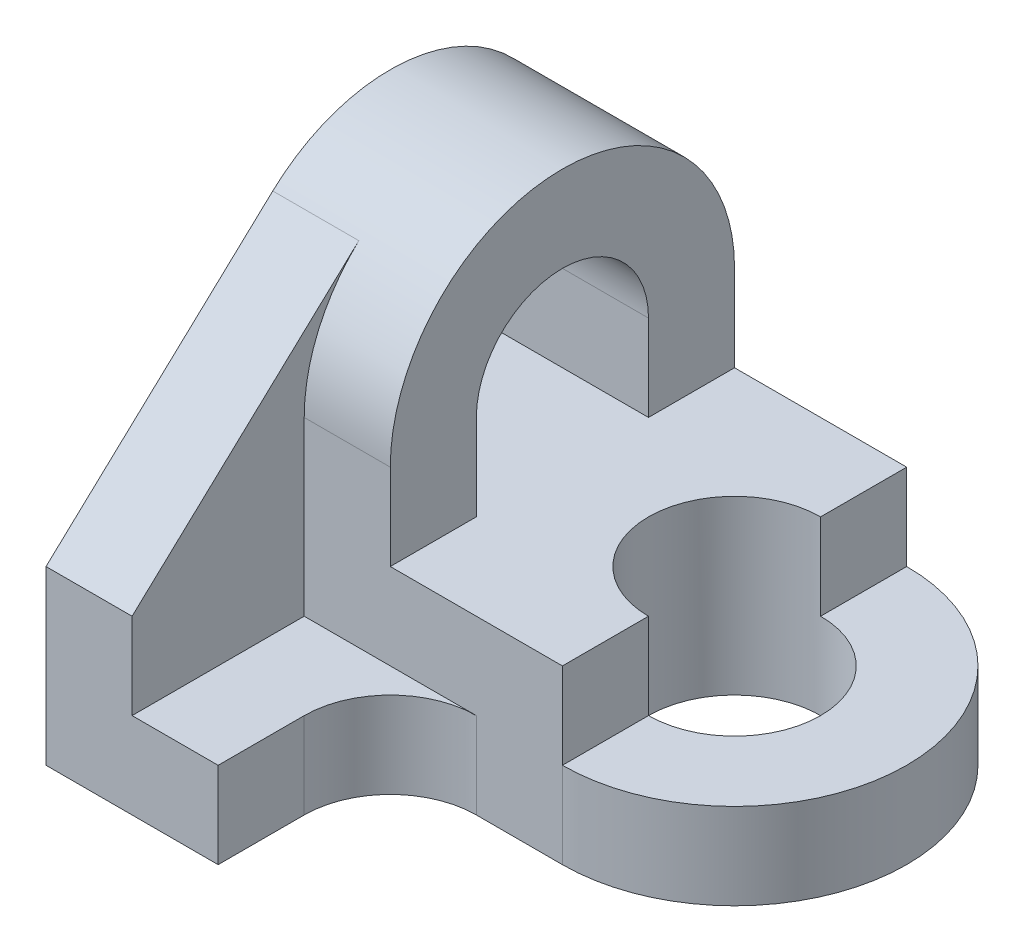
ISO-10303-21;
HEADER;
FILE_DESCRIPTION(('STEP AP214'),'2;1');
FILE_NAME('part.step','',(''),(''),'','','');
FILE_SCHEMA(('AUTOMOTIVE_DESIGN { 1 0 10303 214 1 1 1 1 }'));
ENDSEC;
DATA;
#1=APPLICATION_CONTEXT('core data for automotive mechanical design processes');
#2=APPLICATION_PROTOCOL_DEFINITION('international standard','automotive_design',2000,#1);
#3=PRODUCT_CONTEXT('',#1,'mechanical');
#4=PRODUCT('Part','Part','',(#3));
#5=PRODUCT_RELATED_PRODUCT_CATEGORY('part','',(#4));
#6=PRODUCT_DEFINITION_FORMATION('','',#4);
#7=PRODUCT_DEFINITION_CONTEXT('part definition',#1,'design');
#8=PRODUCT_DEFINITION('design','',#6,#7);
#9=PRODUCT_DEFINITION_SHAPE('','',#8);
#10=(LENGTH_UNIT() NAMED_UNIT(*) SI_UNIT(.MILLI.,.METRE.));
#11=(NAMED_UNIT(*) PLANE_ANGLE_UNIT() SI_UNIT($,.RADIAN.));
#12=(NAMED_UNIT(*) SI_UNIT($,.STERADIAN.) SOLID_ANGLE_UNIT());
#13=UNCERTAINTY_MEASURE_WITH_UNIT(LENGTH_MEASURE(1.E-05),#10,'distance_accuracy_value','');
#14=(GEOMETRIC_REPRESENTATION_CONTEXT(3) GLOBAL_UNCERTAINTY_ASSIGNED_CONTEXT((#13)) GLOBAL_UNIT_ASSIGNED_CONTEXT((#10,
#11,#12)) REPRESENTATION_CONTEXT('',''));
#15=CARTESIAN_POINT('',(0.,0.,0.));
#16=DIRECTION('',(0.,0.,1.));
#17=DIRECTION('',(1.,0.,0.));
#18=AXIS2_PLACEMENT_3D('',#15,#16,#17);
#19=CARTESIAN_POINT('',(0.,0.,0.));
#20=DIRECTION('',(-1.,0.,0.));
#21=DIRECTION('',(0.,0.,1.));
#22=AXIS2_PLACEMENT_3D('',#19,#20,#21);
#23=PLANE('',#22);
#24=DIRECTION('',(0.,1.,0.));
#25=VECTOR('',#24,1.);
#26=CARTESIAN_POINT('',(0.,-0.999999999999999,5.));
#27=LINE('',#26,#25);
#28=CARTESIAN_POINT('',(0.,-0.999999999999999,5.));
#29=VERTEX_POINT('',#28);
#30=CARTESIAN_POINT('',(0.,0.,5.));
#31=VERTEX_POINT('',#30);
#32=EDGE_CURVE('E169',#29,#31,#27,.T.);
#33=ORIENTED_EDGE('',*,*,#32,.T.);
#34=DIRECTION('',(0.,0.,-1.));
#35=VECTOR('',#34,1.);
#36=CARTESIAN_POINT('',(0.,0.,6.));
#37=LINE('',#36,#35);
#38=CARTESIAN_POINT('',(0.,0.,6.));
#39=VERTEX_POINT('',#38);
#40=EDGE_CURVE('E272',#39,#31,#37,.T.);
#41=ORIENTED_EDGE('',*,*,#40,.F.);
#42=DIRECTION('',(0.,1.,0.));
#43=VECTOR('',#42,1.);
#44=CARTESIAN_POINT('',(0.,-1.,6.));
#45=LINE('',#44,#43);
#46=CARTESIAN_POINT('',(0.,-1.,6.));
#47=VERTEX_POINT('',#46);
#48=EDGE_CURVE('E277',#47,#39,#45,.T.);
#49=ORIENTED_EDGE('',*,*,#48,.F.);
#50=DIRECTION('',(0.,0.,1.));
#51=VECTOR('',#50,1.);
#52=CARTESIAN_POINT('',(0.,-1.,4.));
#53=LINE('',#52,#51);
#54=EDGE_CURVE('E275',#29,#47,#53,.T.);
#55=ORIENTED_EDGE('',*,*,#54,.F.);
#56=EDGE_LOOP('',(#33,#41,#49,#55));
#57=FACE_BOUND('',#56,.T.);
#58=ADVANCED_FACE('F33',(#57),#23,.F.);
#59=CARTESIAN_POINT('',(0.,2.,2.));
#60=DIRECTION('',(-1.,0.,0.));
#61=DIRECTION('',(0.,0.,1.));
#62=AXIS2_PLACEMENT_3D('',#59,#60,#61);
#63=CYLINDRICAL_SURFACE('',#62,2.);
#64=CARTESIAN_POINT('',(-2.,2.,2.));
#65=DIRECTION('',(-1.,0.,0.));
#66=DIRECTION('',(0.,0.,-1.));
#67=AXIS2_PLACEMENT_3D('',#64,#65,#66);
#68=CIRCLE('',#67,2.);
#69=CARTESIAN_POINT('',(-2.,3.46143589433599,3.365358973584));
#70=VERTEX_POINT('',#69);
#71=CARTESIAN_POINT('',(-2.,2.,0.));
#72=VERTEX_POINT('',#71);
#73=EDGE_CURVE('E259',#70,#72,#68,.T.);
#74=ORIENTED_EDGE('',*,*,#73,.F.);
#75=DIRECTION('',(-1.,0.,0.));
#76=VECTOR('',#75,1.);
#77=CARTESIAN_POINT('',(-1.,3.46143589433599,3.365358973584));
#78=LINE('',#77,#76);
#79=CARTESIAN_POINT('',(-1.,3.46143589433599,3.365358973584));
#80=VERTEX_POINT('',#79);
#81=EDGE_CURVE('E48',#80,#70,#78,.T.);
#82=ORIENTED_EDGE('',*,*,#81,.F.);
#83=CARTESIAN_POINT('',(-1.,1.99999999999997,1.99999999999994));
#84=DIRECTION('',(1.,0.,0.));
#85=DIRECTION('',(0.,0.,-1.));
#86=AXIS2_PLACEMENT_3D('',#83,#84,#85);
#87=CIRCLE('',#86,2.00000000000006);
#88=CARTESIAN_POINT('',(-1.,2.,4.));
#89=VERTEX_POINT('',#88);
#90=EDGE_CURVE('E338',#80,#89,#87,.T.);
#91=ORIENTED_EDGE('',*,*,#90,.T.);
#92=DIRECTION('',(-1.,0.,0.));
#93=VECTOR('',#92,1.);
#94=CARTESIAN_POINT('',(0.,2.,4.));
#95=LINE('',#94,#93);
#96=CARTESIAN_POINT('',(0.,2.,4.));
#97=VERTEX_POINT('',#96);
#98=EDGE_CURVE('E264',#97,#89,#95,.T.);
#99=ORIENTED_EDGE('',*,*,#98,.F.);
#100=CARTESIAN_POINT('',(0.,2.,2.));
#101=DIRECTION('',(-1.,0.,0.));
#102=DIRECTION('',(0.,0.,-1.));
#103=AXIS2_PLACEMENT_3D('',#100,#101,#102);
#104=CIRCLE('',#103,2.);
#105=CARTESIAN_POINT('',(0.,2.,0.));
#106=VERTEX_POINT('',#105);
#107=EDGE_CURVE('E242',#97,#106,#104,.T.);
#108=ORIENTED_EDGE('',*,*,#107,.T.);
#109=DIRECTION('',(-1.,0.,0.));
#110=VECTOR('',#109,1.);
#111=CARTESIAN_POINT('',(0.,2.,0.));
#112=LINE('',#111,#110);
#113=EDGE_CURVE('E237',#106,#72,#112,.T.);
#114=ORIENTED_EDGE('',*,*,#113,.T.);
#115=EDGE_LOOP('',(#74,#82,#91,#99,#108,#114));
#116=FACE_BOUND('',#115,.T.);
#117=ADVANCED_FACE('F327',(#116),#63,.T.);
#118=CARTESIAN_POINT('',(0.,0.,4.));
#119=DIRECTION('',(0.,0.,-1.));
#120=DIRECTION('',(-1.,0.,0.));
#121=AXIS2_PLACEMENT_3D('',#118,#119,#120);
#122=PLANE('',#121);
#123=DIRECTION('',(-1.,0.,0.));
#124=VECTOR('',#123,1.);
#125=CARTESIAN_POINT('',(0.,0.,4.));
#126=LINE('',#125,#124);
#127=CARTESIAN_POINT('',(1.,0.,4.));
#128=VERTEX_POINT('',#127);
#129=CARTESIAN_POINT('',(-1.,0.,4.));
#130=VERTEX_POINT('',#129);
#131=EDGE_CURVE('E181',#128,#130,#126,.T.);
#132=ORIENTED_EDGE('',*,*,#131,.F.);
#133=DIRECTION('',(0.,1.,0.));
#134=VECTOR('',#133,1.);
#135=CARTESIAN_POINT('',(1.,-0.999999999999999,4.));
#136=LINE('',#135,#134);
#137=CARTESIAN_POINT('',(1.,-0.999999999999999,4.));
#138=VERTEX_POINT('',#137);
#139=EDGE_CURVE('E166',#138,#128,#136,.T.);
#140=ORIENTED_EDGE('',*,*,#139,.F.);
#141=DIRECTION('',(1.,0.,0.));
#142=VECTOR('',#141,1.);
#143=CARTESIAN_POINT('',(-2.,-1.,4.));
#144=LINE('',#143,#142);
#145=CARTESIAN_POINT('',(2.,-1.,4.));
#146=VERTEX_POINT('',#145);
#147=EDGE_CURVE('E178',#138,#146,#144,.T.);
#148=ORIENTED_EDGE('',*,*,#147,.T.);
#149=DIRECTION('',(0.,1.,0.));
#150=VECTOR('',#149,1.);
#151=CARTESIAN_POINT('',(2.,-1.,4.));
#152=LINE('',#151,#150);
#153=CARTESIAN_POINT('',(2.,0.,4.));
#154=VERTEX_POINT('',#153);
#155=EDGE_CURVE('E195',#146,#154,#152,.T.);
#156=ORIENTED_EDGE('',*,*,#155,.T.);
#157=CARTESIAN_POINT('',(2.,1.,4.));
#158=VERTEX_POINT('',#157);
#159=EDGE_CURVE('E208',#154,#158,#152,.T.);
#160=ORIENTED_EDGE('',*,*,#159,.T.);
#161=DIRECTION('',(-1.,0.,0.));
#162=VECTOR('',#161,1.);
#163=CARTESIAN_POINT('',(-2.,1.,4.));
#164=LINE('',#163,#162);
#165=CARTESIAN_POINT('',(0.,1.,4.));
#166=VERTEX_POINT('',#165);
#167=EDGE_CURVE('E189',#158,#166,#164,.T.);
#168=ORIENTED_EDGE('',*,*,#167,.T.);
#169=DIRECTION('',(0.,1.,0.));
#170=VECTOR('',#169,1.);
#171=CARTESIAN_POINT('',(0.,1.,4.));
#172=LINE('',#171,#170);
#173=EDGE_CURVE('E246',#166,#97,#172,.T.);
#174=ORIENTED_EDGE('',*,*,#173,.T.);
#175=ORIENTED_EDGE('',*,*,#98,.T.);
#176=DIRECTION('',(0.,-1.,0.));
#177=VECTOR('',#176,1.);
#178=CARTESIAN_POINT('',(-1.,1.,4.));
#179=LINE('',#178,#177);
#180=EDGE_CURVE('E55',#89,#130,#179,.T.);
#181=ORIENTED_EDGE('',*,*,#180,.T.);
#182=EDGE_LOOP('',(#132,#140,#148,#156,#160,#168,#174,#175,#181));
#183=FACE_BOUND('',#182,.T.);
#184=ADVANCED_FACE('F176',(#183),#122,.F.);
#185=CARTESIAN_POINT('',(0.,0.,6.));
#186=DIRECTION('',(0.,1.,0.));
#187=DIRECTION('',(0.,0.,1.));
#188=AXIS2_PLACEMENT_3D('',#185,#186,#187);
#189=PLANE('',#188);
#190=ORIENTED_EDGE('',*,*,#131,.T.);
#191=DIRECTION('',(0.,0.,-1.));
#192=VECTOR('',#191,1.);
#193=CARTESIAN_POINT('',(-1.,0.,4.));
#194=LINE('',#193,#192);
#195=CARTESIAN_POINT('',(-1.,0.,6.));
#196=VERTEX_POINT('',#195);
#197=EDGE_CURVE('E334',#196,#130,#194,.T.);
#198=ORIENTED_EDGE('',*,*,#197,.F.);
#199=DIRECTION('',(-1.,0.,0.));
#200=VECTOR('',#199,1.);
#201=CARTESIAN_POINT('',(0.,0.,6.));
#202=LINE('',#201,#200);
#203=EDGE_CURVE('E282',#39,#196,#202,.T.);
#204=ORIENTED_EDGE('',*,*,#203,.F.);
#205=ORIENTED_EDGE('',*,*,#40,.T.);
#206=CARTESIAN_POINT('',(1.,0.,5.));
#207=DIRECTION('',(0.,-1.,0.));
#208=DIRECTION('',(0.,0.,1.));
#209=AXIS2_PLACEMENT_3D('',#206,#207,#208);
#210=CIRCLE('',#209,1.);
#211=EDGE_CURVE('E173',#31,#128,#210,.T.);
#212=ORIENTED_EDGE('',*,*,#211,.T.);
#213=EDGE_LOOP('',(#190,#198,#204,#205,#212));
#214=FACE_BOUND('',#213,.T.);
#215=ADVANCED_FACE('F362',(#214),#189,.T.);
#216=CARTESIAN_POINT('',(2.,-1.,4.));
#217=DIRECTION('',(-1.,0.,0.));
#218=DIRECTION('',(0.,0.,1.));
#219=AXIS2_PLACEMENT_3D('',#216,#217,#218);
#220=PLANE('',#219);
#221=DIRECTION('',(0.,0.,-1.));
#222=VECTOR('',#221,1.);
#223=CARTESIAN_POINT('',(2.,0.,4.));
#224=LINE('',#223,#222);
#225=CARTESIAN_POINT('',(2.,0.,3.));
#226=VERTEX_POINT('',#225);
#227=EDGE_CURVE('E230',#154,#226,#224,.T.);
#228=ORIENTED_EDGE('',*,*,#227,.T.);
#229=DIRECTION('',(0.,1.,0.));
#230=VECTOR('',#229,1.);
#231=CARTESIAN_POINT('',(2.,-1.,3.));
#232=LINE('',#231,#230);
#233=CARTESIAN_POINT('',(2.,1.,3.));
#234=VERTEX_POINT('',#233);
#235=EDGE_CURVE('E295',#226,#234,#232,.T.);
#236=ORIENTED_EDGE('',*,*,#235,.T.);
#237=DIRECTION('',(0.,0.,-1.));
#238=VECTOR('',#237,1.);
#239=CARTESIAN_POINT('',(2.,1.,4.));
#240=LINE('',#239,#238);
#241=EDGE_CURVE('E41',#158,#234,#240,.T.);
#242=ORIENTED_EDGE('',*,*,#241,.F.);
#243=ORIENTED_EDGE('',*,*,#159,.F.);
#244=EDGE_LOOP('',(#228,#236,#242,#243));
#245=FACE_BOUND('',#244,.T.);
#246=ADVANCED_FACE('F308',(#245),#220,.F.);
#247=CARTESIAN_POINT('',(2.,1.,1.));
#248=VERTEX_POINT('',#247);
#249=CARTESIAN_POINT('',(2.,1.,0.));
#250=VERTEX_POINT('',#249);
#251=EDGE_CURVE('E211',#248,#250,#240,.T.);
#252=ORIENTED_EDGE('',*,*,#251,.F.);
#253=DIRECTION('',(0.,1.,0.));
#254=VECTOR('',#253,1.);
#255=CARTESIAN_POINT('',(2.,-1.,1.));
#256=LINE('',#255,#254);
#257=CARTESIAN_POINT('',(2.,0.,1.));
#258=VERTEX_POINT('',#257);
#259=EDGE_CURVE('E292',#248,#258,#256,.F.);
#260=ORIENTED_EDGE('',*,*,#259,.T.);
#261=CARTESIAN_POINT('',(2.,0.,0.));
#262=VERTEX_POINT('',#261);
#263=EDGE_CURVE('E227',#258,#262,#224,.T.);
#264=ORIENTED_EDGE('',*,*,#263,.T.);
#265=DIRECTION('',(0.,1.,0.));
#266=VECTOR('',#265,1.);
#267=CARTESIAN_POINT('',(2.,-1.,0.));
#268=LINE('',#267,#266);
#269=EDGE_CURVE('E203',#262,#250,#268,.T.);
#270=ORIENTED_EDGE('',*,*,#269,.T.);
#271=EDGE_LOOP('',(#252,#260,#264,#270));
#272=FACE_BOUND('',#271,.T.);
#273=ADVANCED_FACE('F35',(#272),#220,.F.);
#274=CARTESIAN_POINT('',(-2.,1.,4.));
#275=DIRECTION('',(0.,-1.,0.));
#276=DIRECTION('',(0.,0.,-1.));
#277=AXIS2_PLACEMENT_3D('',#274,#275,#276);
#278=PLANE('',#277);
#279=DIRECTION('',(0.,0.,1.));
#280=VECTOR('',#279,1.);
#281=CARTESIAN_POINT('',(0.,1.,1.));
#282=LINE('',#281,#280);
#283=CARTESIAN_POINT('',(0.,1.,0.));
#284=VERTEX_POINT('',#283);
#285=CARTESIAN_POINT('',(0.,1.,1.));
#286=VERTEX_POINT('',#285);
#287=EDGE_CURVE('E261',#284,#286,#282,.T.);
#288=ORIENTED_EDGE('',*,*,#287,.T.);
#289=DIRECTION('',(-1.,0.,0.));
#290=VECTOR('',#289,1.);
#291=CARTESIAN_POINT('',(0.,1.,1.));
#292=LINE('',#291,#290);
#293=CARTESIAN_POINT('',(-2.,1.,1.));
#294=VERTEX_POINT('',#293);
#295=EDGE_CURVE('E241',#286,#294,#292,.T.);
#296=ORIENTED_EDGE('',*,*,#295,.T.);
#297=DIRECTION('',(0.,0.,-1.));
#298=VECTOR('',#297,1.);
#299=CARTESIAN_POINT('',(-2.,1.,4.));
#300=LINE('',#299,#298);
#301=CARTESIAN_POINT('',(-2.,1.,3.));
#302=VERTEX_POINT('',#301);
#303=EDGE_CURVE('E192',#302,#294,#300,.T.);
#304=ORIENTED_EDGE('',*,*,#303,.F.);
#305=DIRECTION('',(-1.,0.,0.));
#306=VECTOR('',#305,1.);
#307=CARTESIAN_POINT('',(0.,1.,3.));
#308=LINE('',#307,#306);
#309=CARTESIAN_POINT('',(0.,1.,3.));
#310=VERTEX_POINT('',#309);
#311=EDGE_CURVE('E267',#310,#302,#308,.T.);
#312=ORIENTED_EDGE('',*,*,#311,.F.);
#313=DIRECTION('',(0.,0.,1.));
#314=VECTOR('',#313,1.);
#315=CARTESIAN_POINT('',(0.,1.,3.));
#316=LINE('',#315,#314);
#317=EDGE_CURVE('E307',#310,#166,#316,.T.);
#318=ORIENTED_EDGE('',*,*,#317,.T.);
#319=ORIENTED_EDGE('',*,*,#167,.F.);
#320=ORIENTED_EDGE('',*,*,#241,.T.);
#321=CARTESIAN_POINT('',(2.,1.,2.));
#322=DIRECTION('',(0.,1.,0.));
#323=DIRECTION('',(0.,0.,1.));
#324=AXIS2_PLACEMENT_3D('',#321,#322,#323);
#325=CIRCLE('',#324,1.);
#326=EDGE_CURVE('E222',#248,#234,#325,.T.);
#327=ORIENTED_EDGE('',*,*,#326,.F.);
#328=ORIENTED_EDGE('',*,*,#251,.T.);
#329=DIRECTION('',(-1.,0.,0.));
#330=VECTOR('',#329,1.);
#331=CARTESIAN_POINT('',(-2.,1.,0.));
#332=LINE('',#331,#330);
#333=EDGE_CURVE('E202',#250,#284,#332,.T.);
#334=ORIENTED_EDGE('',*,*,#333,.T.);
#335=EDGE_LOOP('',(#288,#296,#304,#312,#318,#319,#320,#327,#328,#334));
#336=FACE_BOUND('',#335,.T.);
#337=ADVANCED_FACE('F219',(#336),#278,.F.);
#338=CARTESIAN_POINT('',(-2.,-1.,4.));
#339=DIRECTION('',(1.,0.,0.));
#340=DIRECTION('',(0.,0.,-1.));
#341=AXIS2_PLACEMENT_3D('',#338,#339,#340);
#342=PLANE('',#341);
#343=DIRECTION('',(0.,0.682679486791999,-0.730717947167998));
#344=VECTOR('',#343,1.);
#345=CARTESIAN_POINT('',(-2.,3.46143589433599,3.365358973584));
#346=LINE('',#345,#344);
#347=CARTESIAN_POINT('',(-2.,1.,6.));
#348=VERTEX_POINT('',#347);
#349=EDGE_CURVE('E326',#348,#70,#346,.T.);
#350=ORIENTED_EDGE('',*,*,#349,.T.);
#351=ORIENTED_EDGE('',*,*,#73,.T.);
#352=DIRECTION('',(0.,-1.,0.));
#353=VECTOR('',#352,1.);
#354=CARTESIAN_POINT('',(-2.,-1.,0.));
#355=LINE('',#354,#353);
#356=CARTESIAN_POINT('',(-2.,-1.,0.));
#357=VERTEX_POINT('',#356);
#358=EDGE_CURVE('E205',#72,#357,#355,.T.);
#359=ORIENTED_EDGE('',*,*,#358,.T.);
#360=DIRECTION('',(0.,0.,-1.));
#361=VECTOR('',#360,1.);
#362=CARTESIAN_POINT('',(-2.,-1.,4.));
#363=LINE('',#362,#361);
#364=CARTESIAN_POINT('',(-2.,-1.,6.));
#365=VERTEX_POINT('',#364);
#366=EDGE_CURVE('E188',#365,#357,#363,.T.);
#367=ORIENTED_EDGE('',*,*,#366,.F.);
#368=DIRECTION('',(0.,1.,0.));
#369=VECTOR('',#368,1.);
#370=CARTESIAN_POINT('',(-2.,-1.,6.));
#371=LINE('',#370,#369);
#372=EDGE_CURVE('E263',#365,#348,#371,.T.);
#373=ORIENTED_EDGE('',*,*,#372,.T.);
#374=EDGE_LOOP('',(#350,#351,#359,#367,#373));
#375=FACE_BOUND('',#374,.T.);
#376=ORIENTED_EDGE('',*,*,#303,.T.);
#377=DIRECTION('',(0.,1.,0.));
#378=VECTOR('',#377,1.);
#379=CARTESIAN_POINT('',(-2.,1.,1.));
#380=LINE('',#379,#378);
#381=CARTESIAN_POINT('',(-2.,2.,1.));
#382=VERTEX_POINT('',#381);
#383=EDGE_CURVE('E250',#294,#382,#380,.T.);
#384=ORIENTED_EDGE('',*,*,#383,.T.);
#385=CARTESIAN_POINT('',(-2.,2.,2.));
#386=DIRECTION('',(1.,0.,0.));
#387=DIRECTION('',(0.,0.,-1.));
#388=AXIS2_PLACEMENT_3D('',#385,#386,#387);
#389=CIRCLE('',#388,1.);
#390=CARTESIAN_POINT('',(-2.,2.,3.));
#391=VERTEX_POINT('',#390);
#392=EDGE_CURVE('E253',#382,#391,#389,.T.);
#393=ORIENTED_EDGE('',*,*,#392,.T.);
#394=DIRECTION('',(0.,-1.,0.));
#395=VECTOR('',#394,1.);
#396=CARTESIAN_POINT('',(-2.,1.,3.));
#397=LINE('',#396,#395);
#398=EDGE_CURVE('E256',#391,#302,#397,.T.);
#399=ORIENTED_EDGE('',*,*,#398,.T.);
#400=EDGE_LOOP('',(#376,#384,#393,#399));
#401=FACE_BOUND('',#400,.T.);
#402=ADVANCED_FACE('F323',(#375,#401),#342,.F.);
#403=CARTESIAN_POINT('',(-2.,-1.,4.));
#404=DIRECTION('',(0.,1.,0.));
#405=DIRECTION('',(0.,0.,1.));
#406=AXIS2_PLACEMENT_3D('',#403,#404,#405);
#407=PLANE('',#406);
#408=ORIENTED_EDGE('',*,*,#147,.F.);
#409=CARTESIAN_POINT('',(1.,-0.999999999999999,5.));
#410=DIRECTION('',(0.,-1.,0.));
#411=DIRECTION('',(0.,0.,1.));
#412=AXIS2_PLACEMENT_3D('',#409,#410,#411);
#413=CIRCLE('',#412,1.);
#414=EDGE_CURVE('E163',#29,#138,#413,.T.);
#415=ORIENTED_EDGE('',*,*,#414,.F.);
#416=ORIENTED_EDGE('',*,*,#54,.T.);
#417=DIRECTION('',(-1.,0.,0.));
#418=VECTOR('',#417,1.);
#419=CARTESIAN_POINT('',(0.,-1.,6.));
#420=LINE('',#419,#418);
#421=EDGE_CURVE('E285',#47,#365,#420,.T.);
#422=ORIENTED_EDGE('',*,*,#421,.T.);
#423=ORIENTED_EDGE('',*,*,#366,.T.);
#424=DIRECTION('',(1.,0.,0.));
#425=VECTOR('',#424,1.);
#426=CARTESIAN_POINT('',(-2.,-1.,0.));
#427=LINE('',#426,#425);
#428=CARTESIAN_POINT('',(2.,-1.,0.));
#429=VERTEX_POINT('',#428);
#430=EDGE_CURVE('E207',#357,#429,#427,.T.);
#431=ORIENTED_EDGE('',*,*,#430,.T.);
#432=CARTESIAN_POINT('',(2.,-1.,2.));
#433=DIRECTION('',(0.,-1.,0.));
#434=DIRECTION('',(0.,0.,1.));
#435=AXIS2_PLACEMENT_3D('',#432,#433,#434);
#436=CIRCLE('',#435,2.);
#437=EDGE_CURVE('E187',#429,#146,#436,.T.);
#438=ORIENTED_EDGE('',*,*,#437,.T.);
#439=EDGE_LOOP('',(#408,#415,#416,#422,#423,#431,#438));
#440=FACE_BOUND('',#439,.T.);
#441=CARTESIAN_POINT('',(2.,-1.,2.));
#442=DIRECTION('',(0.,1.,0.));
#443=DIRECTION('',(0.,0.,1.));
#444=AXIS2_PLACEMENT_3D('',#441,#442,#443);
#445=CIRCLE('',#444,1.);
#446=CARTESIAN_POINT('',(2.,-1.,3.));
#447=VERTEX_POINT('',#446);
#448=EDGE_CURVE('E289',#447,#447,#445,.T.);
#449=ORIENTED_EDGE('',*,*,#448,.T.);
#450=EDGE_LOOP('',(#449));
#451=FACE_BOUND('',#450,.T.);
#452=ADVANCED_FACE('F184',(#440,#451),#407,.F.);
#453=CARTESIAN_POINT('',(0.,0.,0.));
#454=DIRECTION('',(0.,0.,-1.));
#455=DIRECTION('',(-1.,0.,0.));
#456=AXIS2_PLACEMENT_3D('',#453,#454,#455);
#457=PLANE('',#456);
#458=EDGE_CURVE('E199',#429,#262,#268,.T.);
#459=ORIENTED_EDGE('',*,*,#458,.F.);
#460=ORIENTED_EDGE('',*,*,#430,.F.);
#461=ORIENTED_EDGE('',*,*,#358,.F.);
#462=ORIENTED_EDGE('',*,*,#113,.F.);
#463=DIRECTION('',(0.,-1.,0.));
#464=VECTOR('',#463,1.);
#465=CARTESIAN_POINT('',(0.,1.,0.));
#466=LINE('',#465,#464);
#467=EDGE_CURVE('E234',#106,#284,#466,.T.);
#468=ORIENTED_EDGE('',*,*,#467,.T.);
#469=ORIENTED_EDGE('',*,*,#333,.F.);
#470=ORIENTED_EDGE('',*,*,#269,.F.);
#471=EDGE_LOOP('',(#459,#460,#461,#462,#468,#469,#470));
#472=FACE_BOUND('',#471,.T.);
#473=ADVANCED_FACE('F232',(#472),#457,.T.);
#474=CARTESIAN_POINT('',(2.,0.,2.));
#475=DIRECTION('',(0.,-1.,0.));
#476=DIRECTION('',(0.,0.,-1.));
#477=AXIS2_PLACEMENT_3D('',#474,#475,#476);
#478=CYLINDRICAL_SURFACE('',#477,2.);
#479=ORIENTED_EDGE('',*,*,#437,.F.);
#480=ORIENTED_EDGE('',*,*,#458,.T.);
#481=CARTESIAN_POINT('',(2.,0.,2.));
#482=DIRECTION('',(0.,-1.,0.));
#483=DIRECTION('',(0.,0.,1.));
#484=AXIS2_PLACEMENT_3D('',#481,#482,#483);
#485=CIRCLE('',#484,2.);
#486=EDGE_CURVE('E298',#262,#154,#485,.T.);
#487=ORIENTED_EDGE('',*,*,#486,.T.);
#488=ORIENTED_EDGE('',*,*,#155,.F.);
#489=EDGE_LOOP('',(#479,#480,#487,#488));
#490=FACE_BOUND('',#489,.T.);
#491=ADVANCED_FACE('F317',(#490),#478,.T.);
#492=CARTESIAN_POINT('',(2.,0.,2.));
#493=DIRECTION('',(0.,1.,0.));
#494=DIRECTION('',(0.,0.,1.));
#495=AXIS2_PLACEMENT_3D('',#492,#493,#494);
#496=PLANE('',#495);
#497=CARTESIAN_POINT('',(2.,0.,2.));
#498=DIRECTION('',(0.,1.,0.));
#499=DIRECTION('',(0.,0.,1.));
#500=AXIS2_PLACEMENT_3D('',#497,#498,#499);
#501=CIRCLE('',#500,1.);
#502=EDGE_CURVE('E11',#226,#258,#501,.T.);
#503=ORIENTED_EDGE('',*,*,#502,.F.);
#504=ORIENTED_EDGE('',*,*,#227,.F.);
#505=ORIENTED_EDGE('',*,*,#486,.F.);
#506=ORIENTED_EDGE('',*,*,#263,.F.);
#507=EDGE_LOOP('',(#503,#504,#505,#506));
#508=FACE_BOUND('',#507,.T.);
#509=ADVANCED_FACE('F314',(#508),#496,.T.);
#510=CARTESIAN_POINT('',(2.,-1.,2.));
#511=DIRECTION('',(0.,1.,0.));
#512=DIRECTION('',(0.,0.,1.));
#513=AXIS2_PLACEMENT_3D('',#510,#511,#512);
#514=CYLINDRICAL_SURFACE('',#513,1.);
#515=ORIENTED_EDGE('',*,*,#448,.F.);
#516=EDGE_LOOP('',(#515));
#517=FACE_BOUND('',#516,.T.);
#518=ORIENTED_EDGE('',*,*,#502,.T.);
#519=ORIENTED_EDGE('',*,*,#259,.F.);
#520=ORIENTED_EDGE('',*,*,#326,.T.);
#521=ORIENTED_EDGE('',*,*,#235,.F.);
#522=EDGE_LOOP('',(#518,#519,#520,#521));
#523=FACE_BOUND('',#522,.T.);
#524=ADVANCED_FACE('F312',(#517,#523),#514,.F.);
#525=CARTESIAN_POINT('',(0.,-1.,6.));
#526=DIRECTION('',(0.,0.,1.));
#527=DIRECTION('',(1.,0.,0.));
#528=AXIS2_PLACEMENT_3D('',#525,#526,#527);
#529=PLANE('',#528);
#530=ORIENTED_EDGE('',*,*,#372,.F.);
#531=ORIENTED_EDGE('',*,*,#421,.F.);
#532=ORIENTED_EDGE('',*,*,#48,.T.);
#533=ORIENTED_EDGE('',*,*,#203,.T.);
#534=DIRECTION('',(0.,-1.,0.));
#535=VECTOR('',#534,1.);
#536=CARTESIAN_POINT('',(-1.,1.,6.));
#537=LINE('',#536,#535);
#538=CARTESIAN_POINT('',(-1.,1.,6.));
#539=VERTEX_POINT('',#538);
#540=EDGE_CURVE('E342',#539,#196,#537,.T.);
#541=ORIENTED_EDGE('',*,*,#540,.F.);
#542=DIRECTION('',(1.,0.,0.));
#543=VECTOR('',#542,1.);
#544=CARTESIAN_POINT('',(-1.,1.,6.));
#545=LINE('',#544,#543);
#546=EDGE_CURVE('E336',#348,#539,#545,.T.);
#547=ORIENTED_EDGE('',*,*,#546,.F.);
#548=EDGE_LOOP('',(#530,#531,#532,#533,#541,#547));
#549=FACE_BOUND('',#548,.T.);
#550=ADVANCED_FACE('F368',(#549),#529,.T.);
#551=CARTESIAN_POINT('',(0.,1.,3.));
#552=DIRECTION('',(0.,0.,-1.));
#553=DIRECTION('',(-1.,0.,0.));
#554=AXIS2_PLACEMENT_3D('',#551,#552,#553);
#555=PLANE('',#554);
#556=ORIENTED_EDGE('',*,*,#398,.F.);
#557=DIRECTION('',(-1.,0.,0.));
#558=VECTOR('',#557,1.);
#559=CARTESIAN_POINT('',(0.,2.,3.));
#560=LINE('',#559,#558);
#561=CARTESIAN_POINT('',(0.,2.,3.));
#562=VERTEX_POINT('',#561);
#563=EDGE_CURVE('E269',#562,#391,#560,.T.);
#564=ORIENTED_EDGE('',*,*,#563,.F.);
#565=DIRECTION('',(0.,-1.,0.));
#566=VECTOR('',#565,1.);
#567=CARTESIAN_POINT('',(0.,1.,3.));
#568=LINE('',#567,#566);
#569=EDGE_CURVE('E353',#562,#310,#568,.T.);
#570=ORIENTED_EDGE('',*,*,#569,.T.);
#571=ORIENTED_EDGE('',*,*,#311,.T.);
#572=EDGE_LOOP('',(#556,#564,#570,#571));
#573=FACE_BOUND('',#572,.T.);
#574=ADVANCED_FACE('F390',(#573),#555,.T.);
#575=CARTESIAN_POINT('',(0.,2.,2.));
#576=DIRECTION('',(-1.,0.,0.));
#577=DIRECTION('',(0.,0.,1.));
#578=AXIS2_PLACEMENT_3D('',#575,#576,#577);
#579=CYLINDRICAL_SURFACE('',#578,1.);
#580=ORIENTED_EDGE('',*,*,#392,.F.);
#581=DIRECTION('',(-1.,0.,0.));
#582=VECTOR('',#581,1.);
#583=CARTESIAN_POINT('',(0.,2.,1.));
#584=LINE('',#583,#582);
#585=CARTESIAN_POINT('',(0.,2.,1.));
#586=VERTEX_POINT('',#585);
#587=EDGE_CURVE('E244',#586,#382,#584,.T.);
#588=ORIENTED_EDGE('',*,*,#587,.F.);
#589=CARTESIAN_POINT('',(0.,2.,2.));
#590=DIRECTION('',(1.,0.,0.));
#591=DIRECTION('',(0.,0.,-1.));
#592=AXIS2_PLACEMENT_3D('',#589,#590,#591);
#593=CIRCLE('',#592,1.);
#594=EDGE_CURVE('E350',#586,#562,#593,.T.);
#595=ORIENTED_EDGE('',*,*,#594,.T.);
#596=ORIENTED_EDGE('',*,*,#563,.T.);
#597=EDGE_LOOP('',(#580,#588,#595,#596));
#598=FACE_BOUND('',#597,.T.);
#599=ADVANCED_FACE('F539',(#598),#579,.F.);
#600=CARTESIAN_POINT('',(0.,1.,1.));
#601=DIRECTION('',(0.,0.,1.));
#602=DIRECTION('',(1.,0.,0.));
#603=AXIS2_PLACEMENT_3D('',#600,#601,#602);
#604=PLANE('',#603);
#605=ORIENTED_EDGE('',*,*,#383,.F.);
#606=ORIENTED_EDGE('',*,*,#295,.F.);
#607=DIRECTION('',(0.,1.,0.));
#608=VECTOR('',#607,1.);
#609=CARTESIAN_POINT('',(0.,1.,1.));
#610=LINE('',#609,#608);
#611=EDGE_CURVE('E347',#286,#586,#610,.T.);
#612=ORIENTED_EDGE('',*,*,#611,.T.);
#613=ORIENTED_EDGE('',*,*,#587,.T.);
#614=EDGE_LOOP('',(#605,#606,#612,#613));
#615=FACE_BOUND('',#614,.T.);
#616=ADVANCED_FACE('F377',(#615),#604,.T.);
#617=CARTESIAN_POINT('',(0.,2.,2.));
#618=DIRECTION('',(1.,0.,0.));
#619=DIRECTION('',(0.,0.,-1.));
#620=AXIS2_PLACEMENT_3D('',#617,#618,#619);
#621=PLANE('',#620);
#622=ORIENTED_EDGE('',*,*,#287,.F.);
#623=ORIENTED_EDGE('',*,*,#467,.F.);
#624=ORIENTED_EDGE('',*,*,#107,.F.);
#625=ORIENTED_EDGE('',*,*,#173,.F.);
#626=ORIENTED_EDGE('',*,*,#317,.F.);
#627=ORIENTED_EDGE('',*,*,#569,.F.);
#628=ORIENTED_EDGE('',*,*,#594,.F.);
#629=ORIENTED_EDGE('',*,*,#611,.F.);
#630=EDGE_LOOP('',(#622,#623,#624,#625,#626,#627,#628,#629));
#631=FACE_BOUND('',#630,.T.);
#632=ADVANCED_FACE('F356',(#631),#621,.T.);
#633=CARTESIAN_POINT('',(-1.,1.,4.));
#634=DIRECTION('',(-1.,0.,0.));
#635=DIRECTION('',(0.,0.,1.));
#636=AXIS2_PLACEMENT_3D('',#633,#634,#635);
#637=PLANE('',#636);
#638=ORIENTED_EDGE('',*,*,#197,.T.);
#639=ORIENTED_EDGE('',*,*,#180,.F.);
#640=ORIENTED_EDGE('',*,*,#90,.F.);
#641=DIRECTION('',(0.,0.682679486791999,-0.730717947167998));
#642=VECTOR('',#641,1.);
#643=CARTESIAN_POINT('',(-1.,3.46143589433599,3.365358973584));
#644=LINE('',#643,#642);
#645=EDGE_CURVE('E333',#539,#80,#644,.T.);
#646=ORIENTED_EDGE('',*,*,#645,.F.);
#647=ORIENTED_EDGE('',*,*,#540,.T.);
#648=EDGE_LOOP('',(#638,#639,#640,#646,#647));
#649=FACE_BOUND('',#648,.T.);
#650=ADVANCED_FACE('F369',(#649),#637,.F.);
#651=CARTESIAN_POINT('',(-1.,3.46143589433599,3.365358973584));
#652=DIRECTION('',(0.,0.730717947167998,0.682679486791999));
#653=DIRECTION('',(0.,-0.682679486791999,0.730717947167998));
#654=AXIS2_PLACEMENT_3D('',#651,#652,#653);
#655=PLANE('',#654);
#656=ORIENTED_EDGE('',*,*,#349,.F.);
#657=ORIENTED_EDGE('',*,*,#546,.T.);
#658=ORIENTED_EDGE('',*,*,#645,.T.);
#659=ORIENTED_EDGE('',*,*,#81,.T.);
#660=EDGE_LOOP('',(#656,#657,#658,#659));
#661=FACE_BOUND('',#660,.T.);
#662=ADVANCED_FACE('F330',(#661),#655,.T.);
#663=CARTESIAN_POINT('',(1.,-0.999999999999999,5.));
#664=DIRECTION('',(0.,1.,0.));
#665=DIRECTION('',(0.,0.,1.));
#666=AXIS2_PLACEMENT_3D('',#663,#664,#665);
#667=CYLINDRICAL_SURFACE('',#666,1.);
#668=ORIENTED_EDGE('',*,*,#211,.F.);
#669=ORIENTED_EDGE('',*,*,#32,.F.);
#670=ORIENTED_EDGE('',*,*,#414,.T.);
#671=ORIENTED_EDGE('',*,*,#139,.T.);
#672=EDGE_LOOP('',(#668,#669,#670,#671));
#673=FACE_BOUND('',#672,.T.);
#674=ADVANCED_FACE('F165',(#673),#667,.F.);
#675=CLOSED_SHELL('',(#58,#117,#184,#215,#246,#273,#337,#402,#452,#473,#491,#509,#524,#550,#574,
#599,#616,#632,#650,#662,#674));
#676=MANIFOLD_SOLID_BREP('B2',#675);
#677=ADVANCED_BREP_SHAPE_REPRESENTATION('',(#18,#676),#14);
#678=SHAPE_DEFINITION_REPRESENTATION(#9,#677);
ENDSEC;
END-ISO-10303-21;
